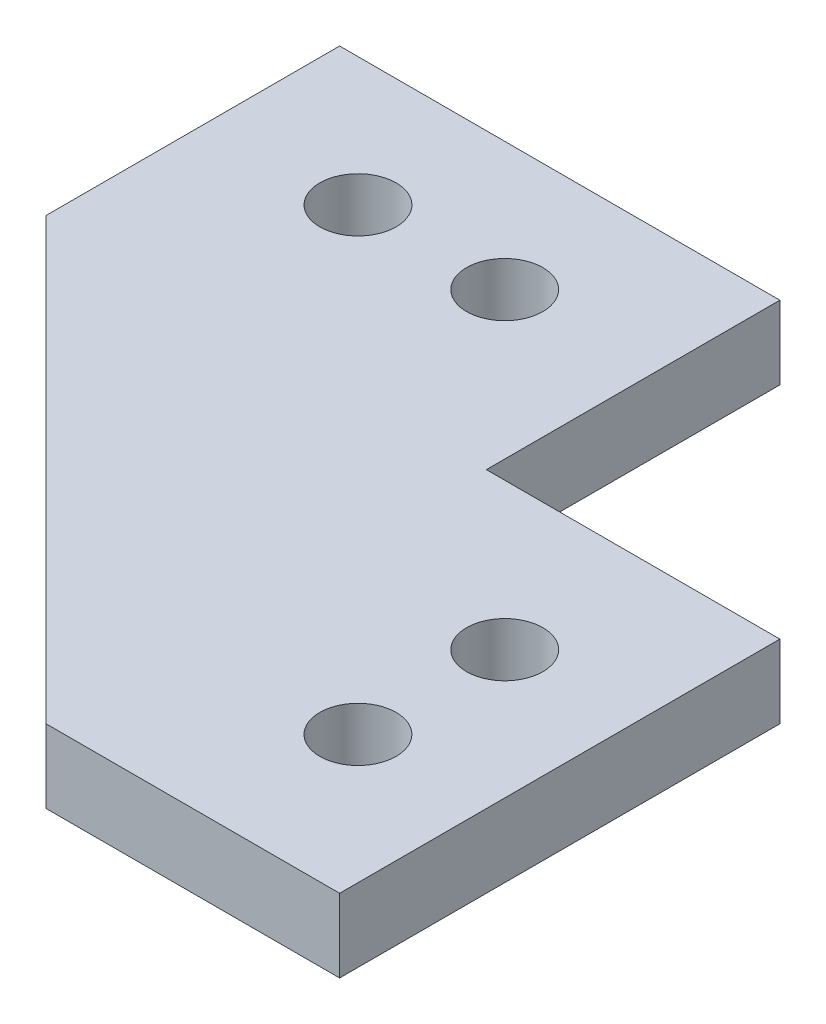
ISO-10303-21;
HEADER;
FILE_DESCRIPTION(('STEP AP214'),'2;1');
FILE_NAME('part.step','',(''),(''),'','','');
FILE_SCHEMA(('AUTOMOTIVE_DESIGN { 1 0 10303 214 1 1 1 1 }'));
ENDSEC;
DATA;
#1=APPLICATION_CONTEXT('core data for automotive mechanical design processes');
#2=APPLICATION_PROTOCOL_DEFINITION('international standard','automotive_design',2000,#1);
#3=PRODUCT_CONTEXT('',#1,'mechanical');
#4=PRODUCT('Part','Part','',(#3));
#5=PRODUCT_RELATED_PRODUCT_CATEGORY('part','',(#4));
#6=PRODUCT_DEFINITION_FORMATION('','',#4);
#7=PRODUCT_DEFINITION_CONTEXT('part definition',#1,'design');
#8=PRODUCT_DEFINITION('design','',#6,#7);
#9=PRODUCT_DEFINITION_SHAPE('','',#8);
#10=(LENGTH_UNIT() NAMED_UNIT(*) SI_UNIT(.MILLI.,.METRE.));
#11=(NAMED_UNIT(*) PLANE_ANGLE_UNIT() SI_UNIT($,.RADIAN.));
#12=(NAMED_UNIT(*) SI_UNIT($,.STERADIAN.) SOLID_ANGLE_UNIT());
#13=UNCERTAINTY_MEASURE_WITH_UNIT(LENGTH_MEASURE(1.E-05),#10,'distance_accuracy_value','');
#14=(GEOMETRIC_REPRESENTATION_CONTEXT(3) GLOBAL_UNCERTAINTY_ASSIGNED_CONTEXT((#13)) GLOBAL_UNIT_ASSIGNED_CONTEXT((#10,
#11,#12)) REPRESENTATION_CONTEXT('',''));
#15=CARTESIAN_POINT('',(0.,0.,0.));
#16=DIRECTION('',(0.,0.,1.));
#17=DIRECTION('',(1.,0.,0.));
#18=AXIS2_PLACEMENT_3D('',#15,#16,#17);
#19=CARTESIAN_POINT('',(0.,3.175,0.));
#20=DIRECTION('',(0.,-1.,0.));
#21=DIRECTION('',(0.,0.,-1.));
#22=AXIS2_PLACEMENT_3D('',#19,#20,#21);
#23=PLANE('',#22);
#24=DIRECTION('',(0.,0.,1.));
#25=VECTOR('',#24,1.);
#26=CARTESIAN_POINT('',(6.35,3.175,0.));
#27=LINE('',#26,#25);
#28=CARTESIAN_POINT('',(6.35,3.175,0.));
#29=VERTEX_POINT('',#28);
#30=CARTESIAN_POINT('',(6.35,3.175,12.7));
#31=VERTEX_POINT('',#30);
#32=EDGE_CURVE('E157',#29,#31,#27,.T.);
#33=ORIENTED_EDGE('',*,*,#32,.T.);
#34=DIRECTION('',(0.707106781186548,0.,0.707106781186548));
#35=VECTOR('',#34,1.);
#36=CARTESIAN_POINT('',(25.4,3.175,31.75));
#37=LINE('',#36,#35);
#38=CARTESIAN_POINT('',(25.4,3.175,31.75));
#39=VERTEX_POINT('',#38);
#40=EDGE_CURVE('E99',#31,#39,#37,.T.);
#41=ORIENTED_EDGE('',*,*,#40,.T.);
#42=DIRECTION('',(1.,0.,0.));
#43=VECTOR('',#42,1.);
#44=CARTESIAN_POINT('',(38.1,3.175,31.75));
#45=LINE('',#44,#43);
#46=CARTESIAN_POINT('',(38.1,3.175,31.75));
#47=VERTEX_POINT('',#46);
#48=EDGE_CURVE('E174',#39,#47,#45,.T.);
#49=ORIENTED_EDGE('',*,*,#48,.T.);
#50=DIRECTION('',(0.,0.,-1.));
#51=VECTOR('',#50,1.);
#52=CARTESIAN_POINT('',(38.1,3.175,12.7));
#53=LINE('',#52,#51);
#54=CARTESIAN_POINT('',(38.1,3.175,12.7));
#55=VERTEX_POINT('',#54);
#56=EDGE_CURVE('E115',#47,#55,#53,.T.);
#57=ORIENTED_EDGE('',*,*,#56,.T.);
#58=DIRECTION('',(-1.,0.,0.));
#59=VECTOR('',#58,1.);
#60=CARTESIAN_POINT('',(38.1,3.175,12.7));
#61=LINE('',#60,#59);
#62=CARTESIAN_POINT('',(25.4,3.175,12.7));
#63=VERTEX_POINT('',#62);
#64=EDGE_CURVE('E109',#55,#63,#61,.T.);
#65=ORIENTED_EDGE('',*,*,#64,.T.);
#66=DIRECTION('',(0.,0.,-1.));
#67=VECTOR('',#66,1.);
#68=CARTESIAN_POINT('',(25.4,3.175,0.));
#69=LINE('',#68,#67);
#70=CARTESIAN_POINT('',(25.4,3.175,0.));
#71=VERTEX_POINT('',#70);
#72=EDGE_CURVE('E113',#63,#71,#69,.T.);
#73=ORIENTED_EDGE('',*,*,#72,.T.);
#74=DIRECTION('',(-1.,0.,0.));
#75=VECTOR('',#74,1.);
#76=CARTESIAN_POINT('',(25.4,3.175,0.));
#77=LINE('',#76,#75);
#78=EDGE_CURVE('E59',#71,#29,#77,.T.);
#79=ORIENTED_EDGE('',*,*,#78,.T.);
#80=EDGE_LOOP('',(#33,#41,#49,#57,#65,#73,#79));
#81=FACE_BOUND('',#80,.T.);
#82=CARTESIAN_POINT('',(32.54375,3.175,19.05));
#83=DIRECTION('',(0.,1.,0.));
#84=DIRECTION('',(0.,0.,1.));
#85=AXIS2_PLACEMENT_3D('',#82,#83,#84);
#86=CIRCLE('',#85,1.65100000000001);
#87=CARTESIAN_POINT('',(32.54375,3.175,20.701));
#88=VERTEX_POINT('',#87);
#89=EDGE_CURVE('E142',#88,#88,#86,.T.);
#90=ORIENTED_EDGE('',*,*,#89,.F.);
#91=EDGE_LOOP('',(#90));
#92=FACE_BOUND('',#91,.T.);
#93=CARTESIAN_POINT('',(32.54375,3.175,25.4));
#94=DIRECTION('',(0.,1.,0.));
#95=DIRECTION('',(0.,0.,1.));
#96=AXIS2_PLACEMENT_3D('',#93,#94,#95);
#97=CIRCLE('',#96,1.65100000000001);
#98=CARTESIAN_POINT('',(32.54375,3.175,27.051));
#99=VERTEX_POINT('',#98);
#100=EDGE_CURVE('E194',#99,#99,#97,.T.);
#101=ORIENTED_EDGE('',*,*,#100,.F.);
#102=EDGE_LOOP('',(#101));
#103=FACE_BOUND('',#102,.T.);
#104=CARTESIAN_POINT('',(12.7,3.175,5.55625000000001));
#105=DIRECTION('',(0.,1.,0.));
#106=DIRECTION('',(0.,0.,-1.));
#107=AXIS2_PLACEMENT_3D('',#104,#105,#106);
#108=CIRCLE('',#107,1.65100000000001);
#109=CARTESIAN_POINT('',(12.7,3.175,3.90525000000001));
#110=VERTEX_POINT('',#109);
#111=EDGE_CURVE('E202',#110,#110,#108,.T.);
#112=ORIENTED_EDGE('',*,*,#111,.F.);
#113=EDGE_LOOP('',(#112));
#114=FACE_BOUND('',#113,.T.);
#115=CARTESIAN_POINT('',(19.05,3.175,5.55624999999999));
#116=DIRECTION('',(0.,1.,0.));
#117=DIRECTION('',(0.,0.,-1.));
#118=AXIS2_PLACEMENT_3D('',#115,#116,#117);
#119=CIRCLE('',#118,1.651);
#120=CARTESIAN_POINT('',(19.05,3.175,3.90524999999999));
#121=VERTEX_POINT('',#120);
#122=EDGE_CURVE('E210',#121,#121,#119,.T.);
#123=ORIENTED_EDGE('',*,*,#122,.F.);
#124=EDGE_LOOP('',(#123));
#125=FACE_BOUND('',#124,.T.);
#126=ADVANCED_FACE('F41',(#81,#92,#103,#114,#125),#23,.F.);
#127=CARTESIAN_POINT('',(0.,0.,0.));
#128=DIRECTION('',(0.,-1.,0.));
#129=DIRECTION('',(0.,0.,-1.));
#130=AXIS2_PLACEMENT_3D('',#127,#128,#129);
#131=PLANE('',#130);
#132=CARTESIAN_POINT('',(12.7,0.,5.55625000000001));
#133=DIRECTION('',(0.,1.,0.));
#134=DIRECTION('',(0.,0.,-1.));
#135=AXIS2_PLACEMENT_3D('',#132,#133,#134);
#136=CIRCLE('',#135,1.65100000000001);
#137=CARTESIAN_POINT('',(12.7,0.,3.90525000000001));
#138=VERTEX_POINT('',#137);
#139=EDGE_CURVE('E206',#138,#138,#136,.T.);
#140=ORIENTED_EDGE('',*,*,#139,.T.);
#141=EDGE_LOOP('',(#140));
#142=FACE_BOUND('',#141,.T.);
#143=CARTESIAN_POINT('',(32.54375,0.,19.05));
#144=DIRECTION('',(0.,1.,0.));
#145=DIRECTION('',(0.,0.,1.));
#146=AXIS2_PLACEMENT_3D('',#143,#144,#145);
#147=CIRCLE('',#146,1.65100000000001);
#148=CARTESIAN_POINT('',(32.54375,0.,20.701));
#149=VERTEX_POINT('',#148);
#150=EDGE_CURVE('E190',#149,#149,#147,.T.);
#151=ORIENTED_EDGE('',*,*,#150,.T.);
#152=EDGE_LOOP('',(#151));
#153=FACE_BOUND('',#152,.T.);
#154=DIRECTION('',(0.,0.,1.));
#155=VECTOR('',#154,1.);
#156=CARTESIAN_POINT('',(6.35,0.,0.));
#157=LINE('',#156,#155);
#158=CARTESIAN_POINT('',(6.35,0.,0.));
#159=VERTEX_POINT('',#158);
#160=CARTESIAN_POINT('',(6.35,0.,12.7));
#161=VERTEX_POINT('',#160);
#162=EDGE_CURVE('E137',#159,#161,#157,.T.);
#163=ORIENTED_EDGE('',*,*,#162,.F.);
#164=DIRECTION('',(-1.,0.,0.));
#165=VECTOR('',#164,1.);
#166=CARTESIAN_POINT('',(25.4,0.,0.));
#167=LINE('',#166,#165);
#168=CARTESIAN_POINT('',(25.4,0.,0.));
#169=VERTEX_POINT('',#168);
#170=EDGE_CURVE('E91',#169,#159,#167,.T.);
#171=ORIENTED_EDGE('',*,*,#170,.F.);
#172=DIRECTION('',(0.,0.,-1.));
#173=VECTOR('',#172,1.);
#174=CARTESIAN_POINT('',(25.4,0.,0.));
#175=LINE('',#174,#173);
#176=CARTESIAN_POINT('',(25.4,0.,12.7));
#177=VERTEX_POINT('',#176);
#178=EDGE_CURVE('E85',#177,#169,#175,.T.);
#179=ORIENTED_EDGE('',*,*,#178,.F.);
#180=DIRECTION('',(-1.,0.,0.));
#181=VECTOR('',#180,1.);
#182=CARTESIAN_POINT('',(38.1,0.,12.7));
#183=LINE('',#182,#181);
#184=CARTESIAN_POINT('',(38.1,0.,12.7));
#185=VERTEX_POINT('',#184);
#186=EDGE_CURVE('E124',#185,#177,#183,.T.);
#187=ORIENTED_EDGE('',*,*,#186,.F.);
#188=DIRECTION('',(0.,0.,-1.));
#189=VECTOR('',#188,1.);
#190=CARTESIAN_POINT('',(38.1,0.,12.7));
#191=LINE('',#190,#189);
#192=CARTESIAN_POINT('',(38.1,0.,31.75));
#193=VERTEX_POINT('',#192);
#194=EDGE_CURVE('E148',#193,#185,#191,.T.);
#195=ORIENTED_EDGE('',*,*,#194,.F.);
#196=DIRECTION('',(1.,0.,0.));
#197=VECTOR('',#196,1.);
#198=CARTESIAN_POINT('',(38.1,0.,31.75));
#199=LINE('',#198,#197);
#200=CARTESIAN_POINT('',(25.4,0.,31.75));
#201=VERTEX_POINT('',#200);
#202=EDGE_CURVE('E145',#201,#193,#199,.T.);
#203=ORIENTED_EDGE('',*,*,#202,.F.);
#204=DIRECTION('',(0.707106781186548,0.,0.707106781186548));
#205=VECTOR('',#204,1.);
#206=CARTESIAN_POINT('',(25.4,0.,31.75));
#207=LINE('',#206,#205);
#208=EDGE_CURVE('E141',#161,#201,#207,.T.);
#209=ORIENTED_EDGE('',*,*,#208,.F.);
#210=EDGE_LOOP('',(#163,#171,#179,#187,#195,#203,#209));
#211=FACE_BOUND('',#210,.T.);
#212=CARTESIAN_POINT('',(32.54375,0.,25.4));
#213=DIRECTION('',(0.,1.,0.));
#214=DIRECTION('',(0.,0.,1.));
#215=AXIS2_PLACEMENT_3D('',#212,#213,#214);
#216=CIRCLE('',#215,1.65100000000001);
#217=CARTESIAN_POINT('',(32.54375,0.,27.051));
#218=VERTEX_POINT('',#217);
#219=EDGE_CURVE('E198',#218,#218,#216,.T.);
#220=ORIENTED_EDGE('',*,*,#219,.T.);
#221=EDGE_LOOP('',(#220));
#222=FACE_BOUND('',#221,.T.);
#223=CARTESIAN_POINT('',(19.05,0.,5.55624999999999));
#224=DIRECTION('',(0.,1.,0.));
#225=DIRECTION('',(0.,0.,-1.));
#226=AXIS2_PLACEMENT_3D('',#223,#224,#225);
#227=CIRCLE('',#226,1.651);
#228=CARTESIAN_POINT('',(19.05,0.,3.90524999999999));
#229=VERTEX_POINT('',#228);
#230=EDGE_CURVE('E214',#229,#229,#227,.T.);
#231=ORIENTED_EDGE('',*,*,#230,.T.);
#232=EDGE_LOOP('',(#231));
#233=FACE_BOUND('',#232,.T.);
#234=ADVANCED_FACE('F178',(#142,#153,#211,#222,#233),#131,.T.);
#235=CARTESIAN_POINT('',(6.35,3.175,0.));
#236=DIRECTION('',(1.,0.,0.));
#237=DIRECTION('',(0.,0.,-1.));
#238=AXIS2_PLACEMENT_3D('',#235,#236,#237);
#239=PLANE('',#238);
#240=ORIENTED_EDGE('',*,*,#162,.T.);
#241=DIRECTION('',(0.,-1.,0.));
#242=VECTOR('',#241,1.);
#243=CARTESIAN_POINT('',(6.35,3.175,12.7));
#244=LINE('',#243,#242);
#245=EDGE_CURVE('E11',#31,#161,#244,.T.);
#246=ORIENTED_EDGE('',*,*,#245,.F.);
#247=ORIENTED_EDGE('',*,*,#32,.F.);
#248=DIRECTION('',(0.,-1.,0.));
#249=VECTOR('',#248,1.);
#250=CARTESIAN_POINT('',(6.35,3.175,0.));
#251=LINE('',#250,#249);
#252=EDGE_CURVE('E133',#29,#159,#251,.T.);
#253=ORIENTED_EDGE('',*,*,#252,.T.);
#254=EDGE_LOOP('',(#240,#246,#247,#253));
#255=FACE_BOUND('',#254,.T.);
#256=ADVANCED_FACE('F43',(#255),#239,.F.);
#257=CARTESIAN_POINT('',(25.4,3.175,31.75));
#258=DIRECTION('',(0.707106781186548,0.,-0.707106781186548));
#259=DIRECTION('',(-0.707106781186548,0.,-0.707106781186548));
#260=AXIS2_PLACEMENT_3D('',#257,#258,#259);
#261=PLANE('',#260);
#262=ORIENTED_EDGE('',*,*,#208,.T.);
#263=DIRECTION('',(0.,-1.,0.));
#264=VECTOR('',#263,1.);
#265=CARTESIAN_POINT('',(25.4,3.175,31.75));
#266=LINE('',#265,#264);
#267=EDGE_CURVE('E51',#39,#201,#266,.T.);
#268=ORIENTED_EDGE('',*,*,#267,.F.);
#269=ORIENTED_EDGE('',*,*,#40,.F.);
#270=ORIENTED_EDGE('',*,*,#245,.T.);
#271=EDGE_LOOP('',(#262,#268,#269,#270));
#272=FACE_BOUND('',#271,.T.);
#273=ADVANCED_FACE('F246',(#272),#261,.F.);
#274=CARTESIAN_POINT('',(38.1,3.175,31.75));
#275=DIRECTION('',(0.,0.,-1.));
#276=DIRECTION('',(-1.,0.,0.));
#277=AXIS2_PLACEMENT_3D('',#274,#275,#276);
#278=PLANE('',#277);
#279=ORIENTED_EDGE('',*,*,#202,.T.);
#280=DIRECTION('',(0.,-1.,0.));
#281=VECTOR('',#280,1.);
#282=CARTESIAN_POINT('',(38.1,3.175,31.75));
#283=LINE('',#282,#281);
#284=EDGE_CURVE('E164',#47,#193,#283,.T.);
#285=ORIENTED_EDGE('',*,*,#284,.F.);
#286=ORIENTED_EDGE('',*,*,#48,.F.);
#287=ORIENTED_EDGE('',*,*,#267,.T.);
#288=EDGE_LOOP('',(#279,#285,#286,#287));
#289=FACE_BOUND('',#288,.T.);
#290=ADVANCED_FACE('F172',(#289),#278,.F.);
#291=CARTESIAN_POINT('',(38.1,3.175,12.7));
#292=DIRECTION('',(-1.,0.,0.));
#293=DIRECTION('',(0.,0.,1.));
#294=AXIS2_PLACEMENT_3D('',#291,#292,#293);
#295=PLANE('',#294);
#296=ORIENTED_EDGE('',*,*,#194,.T.);
#297=DIRECTION('',(0.,-1.,0.));
#298=VECTOR('',#297,1.);
#299=CARTESIAN_POINT('',(38.1,3.175,12.7));
#300=LINE('',#299,#298);
#301=EDGE_CURVE('E126',#55,#185,#300,.T.);
#302=ORIENTED_EDGE('',*,*,#301,.F.);
#303=ORIENTED_EDGE('',*,*,#56,.F.);
#304=ORIENTED_EDGE('',*,*,#284,.T.);
#305=EDGE_LOOP('',(#296,#302,#303,#304));
#306=FACE_BOUND('',#305,.T.);
#307=ADVANCED_FACE('F181',(#306),#295,.F.);
#308=CARTESIAN_POINT('',(38.1,3.175,12.7));
#309=DIRECTION('',(0.,0.,1.));
#310=DIRECTION('',(1.,0.,0.));
#311=AXIS2_PLACEMENT_3D('',#308,#309,#310);
#312=PLANE('',#311);
#313=ORIENTED_EDGE('',*,*,#186,.T.);
#314=DIRECTION('',(0.,-1.,0.));
#315=VECTOR('',#314,1.);
#316=CARTESIAN_POINT('',(25.4,3.175,12.7));
#317=LINE('',#316,#315);
#318=EDGE_CURVE('E121',#63,#177,#317,.T.);
#319=ORIENTED_EDGE('',*,*,#318,.F.);
#320=ORIENTED_EDGE('',*,*,#64,.F.);
#321=ORIENTED_EDGE('',*,*,#301,.T.);
#322=EDGE_LOOP('',(#313,#319,#320,#321));
#323=FACE_BOUND('',#322,.T.);
#324=ADVANCED_FACE('F122',(#323),#312,.F.);
#325=CARTESIAN_POINT('',(25.4,3.175,0.));
#326=DIRECTION('',(-1.,0.,0.));
#327=DIRECTION('',(0.,0.,1.));
#328=AXIS2_PLACEMENT_3D('',#325,#326,#327);
#329=PLANE('',#328);
#330=ORIENTED_EDGE('',*,*,#178,.T.);
#331=DIRECTION('',(0.,-1.,0.));
#332=VECTOR('',#331,1.);
#333=CARTESIAN_POINT('',(25.4,3.175,0.));
#334=LINE('',#333,#332);
#335=EDGE_CURVE('E127',#71,#169,#334,.T.);
#336=ORIENTED_EDGE('',*,*,#335,.F.);
#337=ORIENTED_EDGE('',*,*,#72,.F.);
#338=ORIENTED_EDGE('',*,*,#318,.T.);
#339=EDGE_LOOP('',(#330,#336,#337,#338));
#340=FACE_BOUND('',#339,.T.);
#341=ADVANCED_FACE('F129',(#340),#329,.F.);
#342=CARTESIAN_POINT('',(25.4,3.175,0.));
#343=DIRECTION('',(0.,0.,1.));
#344=DIRECTION('',(1.,0.,0.));
#345=AXIS2_PLACEMENT_3D('',#342,#343,#344);
#346=PLANE('',#345);
#347=ORIENTED_EDGE('',*,*,#170,.T.);
#348=ORIENTED_EDGE('',*,*,#252,.F.);
#349=ORIENTED_EDGE('',*,*,#78,.F.);
#350=ORIENTED_EDGE('',*,*,#335,.T.);
#351=EDGE_LOOP('',(#347,#348,#349,#350));
#352=FACE_BOUND('',#351,.T.);
#353=ADVANCED_FACE('F236',(#352),#346,.F.);
#354=CARTESIAN_POINT('',(32.54375,3.175,19.05));
#355=DIRECTION('',(0.,-1.,0.));
#356=DIRECTION('',(0.,0.,-1.));
#357=AXIS2_PLACEMENT_3D('',#354,#355,#356);
#358=CYLINDRICAL_SURFACE('',#357,1.65100000000001);
#359=ORIENTED_EDGE('',*,*,#89,.T.);
#360=EDGE_LOOP('',(#359));
#361=FACE_BOUND('',#360,.T.);
#362=ORIENTED_EDGE('',*,*,#150,.F.);
#363=EDGE_LOOP('',(#362));
#364=FACE_BOUND('',#363,.T.);
#365=ADVANCED_FACE('F233',(#361,#364),#358,.F.);
#366=CARTESIAN_POINT('',(32.54375,3.175,25.4));
#367=DIRECTION('',(0.,-1.,0.));
#368=DIRECTION('',(0.,0.,-1.));
#369=AXIS2_PLACEMENT_3D('',#366,#367,#368);
#370=CYLINDRICAL_SURFACE('',#369,1.65100000000001);
#371=ORIENTED_EDGE('',*,*,#100,.T.);
#372=EDGE_LOOP('',(#371));
#373=FACE_BOUND('',#372,.T.);
#374=ORIENTED_EDGE('',*,*,#219,.F.);
#375=EDGE_LOOP('',(#374));
#376=FACE_BOUND('',#375,.T.);
#377=ADVANCED_FACE('F305',(#373,#376),#370,.F.);
#378=CARTESIAN_POINT('',(12.7,3.175,5.55625000000001));
#379=DIRECTION('',(0.,-1.,0.));
#380=DIRECTION('',(0.,0.,-1.));
#381=AXIS2_PLACEMENT_3D('',#378,#379,#380);
#382=CYLINDRICAL_SURFACE('',#381,1.65100000000001);
#383=ORIENTED_EDGE('',*,*,#111,.T.);
#384=EDGE_LOOP('',(#383));
#385=FACE_BOUND('',#384,.T.);
#386=ORIENTED_EDGE('',*,*,#139,.F.);
#387=EDGE_LOOP('',(#386));
#388=FACE_BOUND('',#387,.T.);
#389=ADVANCED_FACE('F313',(#385,#388),#382,.F.);
#390=CARTESIAN_POINT('',(19.05,3.175,5.55624999999999));
#391=DIRECTION('',(0.,-1.,0.));
#392=DIRECTION('',(0.,0.,-1.));
#393=AXIS2_PLACEMENT_3D('',#390,#391,#392);
#394=CYLINDRICAL_SURFACE('',#393,1.651);
#395=ORIENTED_EDGE('',*,*,#122,.T.);
#396=EDGE_LOOP('',(#395));
#397=FACE_BOUND('',#396,.T.);
#398=ORIENTED_EDGE('',*,*,#230,.F.);
#399=EDGE_LOOP('',(#398));
#400=FACE_BOUND('',#399,.T.);
#401=ADVANCED_FACE('F222',(#397,#400),#394,.F.);
#402=CLOSED_SHELL('',(#126,#234,#256,#273,#290,#307,#324,#341,#353,#365,#377,#389,#401));
#403=MANIFOLD_SOLID_BREP('B2',#402);
#404=ADVANCED_BREP_SHAPE_REPRESENTATION('',(#18,#403),#14);
#405=SHAPE_DEFINITION_REPRESENTATION(#9,#404);
ENDSEC;
END-ISO-10303-21;
